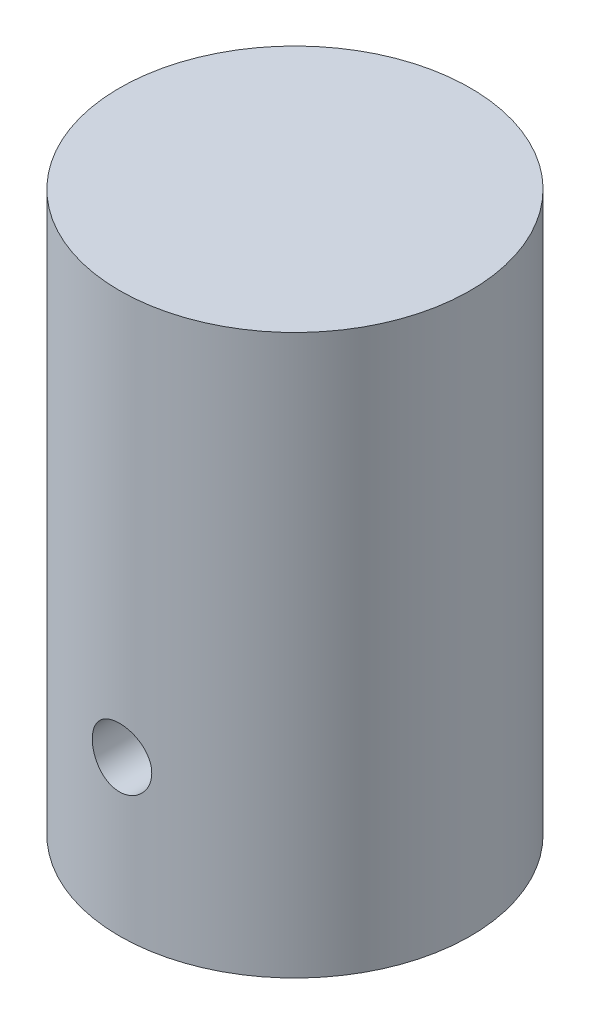
ISO-10303-21;
HEADER;
FILE_DESCRIPTION(('STEP AP214'),'2;1');
FILE_NAME('part.step','',(''),(''),'','','');
FILE_SCHEMA(('AUTOMOTIVE_DESIGN { 1 0 10303 214 1 1 1 1 }'));
ENDSEC;
DATA;
#1=APPLICATION_CONTEXT('core data for automotive mechanical design processes');
#2=APPLICATION_PROTOCOL_DEFINITION('international standard','automotive_design',2000,#1);
#3=PRODUCT_CONTEXT('',#1,'mechanical');
#4=PRODUCT('Part','Part','',(#3));
#5=PRODUCT_RELATED_PRODUCT_CATEGORY('part','',(#4));
#6=PRODUCT_DEFINITION_FORMATION('','',#4);
#7=PRODUCT_DEFINITION_CONTEXT('part definition',#1,'design');
#8=PRODUCT_DEFINITION('design','',#6,#7);
#9=PRODUCT_DEFINITION_SHAPE('','',#8);
#10=(LENGTH_UNIT() NAMED_UNIT(*) SI_UNIT(.MILLI.,.METRE.));
#11=(NAMED_UNIT(*) PLANE_ANGLE_UNIT() SI_UNIT($,.RADIAN.));
#12=(NAMED_UNIT(*) SI_UNIT($,.STERADIAN.) SOLID_ANGLE_UNIT());
#13=UNCERTAINTY_MEASURE_WITH_UNIT(LENGTH_MEASURE(1.E-05),#10,'distance_accuracy_value','');
#14=(GEOMETRIC_REPRESENTATION_CONTEXT(3) GLOBAL_UNCERTAINTY_ASSIGNED_CONTEXT((#13)) GLOBAL_UNIT_ASSIGNED_CONTEXT((#10,
#11,#12)) REPRESENTATION_CONTEXT('',''));
#15=CARTESIAN_POINT('',(0.,0.,0.));
#16=DIRECTION('',(0.,0.,1.));
#17=DIRECTION('',(1.,0.,0.));
#18=AXIS2_PLACEMENT_3D('',#15,#16,#17);
#19=CARTESIAN_POINT('',(0.,119.38,0.));
#20=DIRECTION('',(0.,-1.,0.));
#21=DIRECTION('',(0.,0.,-1.));
#22=AXIS2_PLACEMENT_3D('',#19,#20,#21);
#23=CYLINDRICAL_SURFACE('',#22,37.465);
#24=CARTESIAN_POINT('',(6.35,33.02,36.9229430706708));
#25=CARTESIAN_POINT('',(6.35000279141171,32.8429779279102,36.9229417748591));
#26=CARTESIAN_POINT('',(6.34259532528094,32.6659933481382,36.924218600387));
#27=CARTESIAN_POINT('',(6.3130271330691,32.313242688087,36.9292858540445));
#28=CARTESIAN_POINT('',(6.29086351707607,32.1374768533069,36.9330767745454));
#29=CARTESIAN_POINT('',(6.23193058823662,31.7883737158959,36.9430663826917));
#30=CARTESIAN_POINT('',(6.19515215922365,31.6150379990775,36.9492665730948));
#31=CARTESIAN_POINT('',(6.10725675226593,31.2720688886345,36.9638962260846));
#32=CARTESIAN_POINT('',(6.05613450827856,31.1024368794501,36.9723265073391));
#33=CARTESIAN_POINT('',(5.94001398475862,30.7683400061689,36.9911598987731));
#34=CARTESIAN_POINT('',(5.87503283304677,30.6038690489028,37.0015605720459));
#35=CARTESIAN_POINT('',(5.73160931419481,30.2809531587946,37.024048226987));
#36=CARTESIAN_POINT('',(5.65316198508221,30.1225104736148,37.0361358299416));
#37=CARTESIAN_POINT('',(5.48342916226199,29.8128734349299,37.0616457673502));
#38=CARTESIAN_POINT('',(5.39214998328585,29.6616755649309,37.0750674443417));
#39=CARTESIAN_POINT('',(5.19733044249672,29.367411205207,37.1028794422679));
#40=CARTESIAN_POINT('',(5.09378551997719,29.2243477695128,37.1172701226382));
#41=CARTESIAN_POINT('',(4.87421779068985,28.9461597195228,37.146744116124));
#42=CARTESIAN_POINT('',(4.75809364747908,28.8111156041066,37.1618323914032));
#43=CARTESIAN_POINT('',(4.51488121897134,28.551215519359,37.1921643883722));
#44=CARTESIAN_POINT('',(4.3877888897322,28.4263633410675,37.2074081655528));
#45=CARTESIAN_POINT('',(4.12358831809976,28.1877967478572,37.2376142207968));
#46=CARTESIAN_POINT('',(3.98648315756614,28.0740789308957,37.2525765837088));
#47=CARTESIAN_POINT('',(3.70310692352254,27.858487943453,37.281812153211));
#48=CARTESIAN_POINT('',(3.55683248965142,27.7566191549295,37.2960851037118));
#49=CARTESIAN_POINT('',(3.25528646093831,27.564937093672,37.3236169600895));
#50=CARTESIAN_POINT('',(3.09996739305173,27.4751975512082,37.3368694703722));
#51=CARTESIAN_POINT('',(2.78214446136281,27.309103441585,37.3618966515687));
#52=CARTESIAN_POINT('',(2.61963794116679,27.2327538758421,37.3736707698099));
#53=CARTESIAN_POINT('',(2.28869512625808,27.0940797494783,37.3953948025334));
#54=CARTESIAN_POINT('',(2.12026136913199,27.0317492694472,37.4053454866114));
#55=CARTESIAN_POINT('',(1.77860742000098,26.9215298267097,37.4231499027759));
#56=CARTESIAN_POINT('',(1.60538550554222,26.8736461367658,37.4310028691218));
#57=CARTESIAN_POINT('',(1.08386846683103,26.7531119562433,37.4509148486679));
#58=CARTESIAN_POINT('',(0.73015872504387,26.7020912500178,37.4595677631988));
#59=CARTESIAN_POINT('',(0.0192946776186457,26.6600414383014,37.4666841086695));
#60=CARTESIAN_POINT('',(-0.337859384488472,26.669008122004,37.4651482548085));
#61=CARTESIAN_POINT('',(-1.04184938818574,26.7461584808905,37.4521482632217));
#62=CARTESIAN_POINT('',(-1.38875354291931,26.8137347170075,37.4407859717608));
#63=CARTESIAN_POINT('',(-2.06621277185893,27.0052502774216,37.4095186888445));
#64=CARTESIAN_POINT('',(-2.39676733453492,27.1291913639717,37.3896134302934));
#65=CARTESIAN_POINT('',(-3.03396211682997,27.4305133275901,37.3433249625064));
#66=CARTESIAN_POINT('',(-3.34048213700312,27.6081436009934,37.316911630219));
#67=CARTESIAN_POINT('',(-3.91959227462119,28.0116203392101,37.2605395168837));
#68=CARTESIAN_POINT('',(-4.19217955142351,28.2374708364357,37.2305804394166));
#69=CARTESIAN_POINT('',(-4.69927895714922,28.7343438510591,37.1700034224869));
#70=CARTESIAN_POINT('',(-4.93327053922575,29.0058975034978,37.1393819324612));
#71=CARTESIAN_POINT('',(-5.35245392593285,29.5846815641848,37.0812942455192));
#72=CARTESIAN_POINT('',(-5.53764525006624,29.8919123236743,37.0538280796725));
#73=CARTESIAN_POINT('',(-5.85407953710823,30.5339442406,37.0051585911984));
#74=CARTESIAN_POINT('',(-5.98525815710648,30.8687777135642,36.9839627465329));
#75=CARTESIAN_POINT('',(-6.18936206426045,31.556167311694,36.9503562312994));
#76=CARTESIAN_POINT('',(-6.26229266738911,31.9087218164371,36.9379447590422));
#77=CARTESIAN_POINT('',(-6.34709384460755,32.6168835055322,36.9234678421246));
#78=CARTESIAN_POINT('',(-6.35970721768158,32.9723992502977,36.9212765456527));
#79=CARTESIAN_POINT('',(-6.32549683373919,33.6804613982253,36.9271526737609));
#80=CARTESIAN_POINT('',(-6.27867545446003,34.0330079196058,36.9352196879487));
#81=CARTESIAN_POINT('',(-6.12755856328144,34.7227539742049,36.9605870866626));
#82=CARTESIAN_POINT('',(-6.02364259931067,35.0600391050828,36.9778264723004));
#83=CARTESIAN_POINT('',(-5.76168490296192,35.7124080067798,37.0195448040393));
#84=CARTESIAN_POINT('',(-5.60363983348741,36.0274904073409,37.0440241964792));
#85=CARTESIAN_POINT('',(-5.23616310891025,36.629811414514,37.0977560143979));
#86=CARTESIAN_POINT('',(-5.02625632334476,36.9167562145644,37.1270516831742));
#87=CARTESIAN_POINT('',(-4.56166401992295,37.4516159849238,37.1869892749972));
#88=CARTESIAN_POINT('',(-4.30697524051591,37.6995281099207,37.217631295979));
#89=CARTESIAN_POINT('',(-3.75675903815107,38.1520061184341,37.2772080912782));
#90=CARTESIAN_POINT('',(-3.46082109485542,38.3560760897849,37.3061209088732));
#91=CARTESIAN_POINT('',(-2.83841657324286,38.7115984068522,37.3586264947807));
#92=CARTESIAN_POINT('',(-2.51195100873064,38.8630524991246,37.3822194396744));
#93=CARTESIAN_POINT('',(-1.83928606066536,39.1082817900893,37.421334207005));
#94=CARTESIAN_POINT('',(-1.49318246426715,39.2023144056904,37.4368920013525));
#95=CARTESIAN_POINT('',(-0.789612381808293,39.33083762764,37.4583264559331));
#96=CARTESIAN_POINT('',(-0.432146866718397,39.365333308058,37.4642039411742));
#97=CARTESIAN_POINT('',(0.101984465339863,39.3716501433896,37.4652822069458));
#98=CARTESIAN_POINT('',(0.278660824538069,39.3663448034955,37.4643792461815));
#99=CARTESIAN_POINT('',(0.630910248375704,39.3410416873006,37.4600999348255));
#100=CARTESIAN_POINT('',(0.806483702727592,39.3210494338571,37.4567245139773));
#101=CARTESIAN_POINT('',(1.15534231245423,39.2665096396473,37.4475887044141));
#102=CARTESIAN_POINT('',(1.32862663390469,39.2319569375789,37.4418274700023));
#103=CARTESIAN_POINT('',(1.67157269701812,39.1485780582277,37.4280844037534));
#104=CARTESIAN_POINT('',(1.84123571960936,39.0997570208375,37.4201033716055));
#105=CARTESIAN_POINT('',(2.17567198668656,38.9882491419048,37.4021483486495));
#106=CARTESIAN_POINT('',(2.34044923358439,38.925574026656,37.3921760439695));
#107=CARTESIAN_POINT('',(2.66407136469494,38.7868196261229,37.3705130033313));
#108=CARTESIAN_POINT('',(2.82291834908299,38.7107451418,37.3588228831101));
#109=CARTESIAN_POINT('',(3.13372361602806,38.5456899649814,37.3340369935162));
#110=CARTESIAN_POINT('',(3.28567916728831,38.4567042130054,37.3209406736277));
#111=CARTESIAN_POINT('',(3.58156051285462,38.266507812355,37.2937088207987));
#112=CARTESIAN_POINT('',(3.72548910131004,38.1653014569379,37.2795736534978));
#113=CARTESIAN_POINT('',(4.0061175405423,37.9500279829882,37.2504683547157));
#114=CARTESIAN_POINT('',(4.14270774436707,37.8358189937871,37.2354901389976));
#115=CARTESIAN_POINT('',(4.40575720486539,37.5963983703591,37.2052826069384));
#116=CARTESIAN_POINT('',(4.53222005739372,37.4711906747823,37.1900533820582));
#117=CARTESIAN_POINT('',(4.77427711512343,37.2105169336016,37.1597550265217));
#118=CARTESIAN_POINT('',(4.8898647624007,37.0750447861258,37.1446859972621));
#119=CARTESIAN_POINT('',(5.10924511026962,36.7948850831837,37.1151463601762));
#120=CARTESIAN_POINT('',(5.2130421433657,36.6502009433935,37.1006755337894));
#121=CARTESIAN_POINT('',(5.40891750548062,36.3514062770834,37.0726274388618));
#122=CARTESIAN_POINT('',(5.50089893076861,36.1972314673241,37.0590579519227));
#123=CARTESIAN_POINT('',(5.67149208696552,35.8816160179082,37.0333342280351));
#124=CARTESIAN_POINT('',(5.75010873763827,35.720178079709,37.0211794708262));
#125=CARTESIAN_POINT('',(5.89338024297566,35.3912284690087,36.9986426334629));
#126=CARTESIAN_POINT('',(5.95804473056657,35.2237210809342,36.9882593312945));
#127=CARTESIAN_POINT('',(6.0729737087923,34.8837837201648,36.9695630766091));
#128=CARTESIAN_POINT('',(6.1232412714356,34.7113548062705,36.9612496824657));
#129=CARTESIAN_POINT('',(6.22707453855869,34.2892845729493,36.9439259134538));
#130=CARTESIAN_POINT('',(6.27311607180392,34.037703905521,36.9360961033579));
#131=CARTESIAN_POINT('',(6.3345764955392,33.530722778203,36.9256056660701));
#132=CARTESIAN_POINT('',(6.34999597389238,33.2753223917367,36.9229449396454));
#133=CARTESIAN_POINT('',(6.35,33.02,36.9229430706708));
#134=B_SPLINE_CURVE_WITH_KNOTS('',3,(#24,#25,#26,#27,#28,#29,#30,#31,#32,#33,#34,#35,#36,#37,
#38,#39,#40,#41,#42,#43,#44,#45,#46,#47,#48,#49,#50,#51,#52,#53,#54,#55,#56,#57,#58,#59,#60,#61,
#62,#63,#64,#65,#66,#67,#68,#69,#70,#71,#72,#73,#74,#75,#76,#77,#78,#79,#80,#81,#82,#83,#84,#85,
#86,#87,#88,#89,#90,#91,#92,#93,#94,#95,#96,#97,#98,#99,#100,#101,#102,#103,#104,#105,#106,#107,
#108,#109,#110,#111,#112,#113,#114,#115,#116,#117,#118,#119,#120,#121,#122,#123,#124,#125,#126,
#127,#128,#129,#130,#131,#132,#133),.UNSPECIFIED.,.T.,.F.,(4,2,2,2,2,2,2,2,2,2,2,2,2,2,2,2,2,2,
2,2,2,2,2,2,2,2,2,2,2,2,2,2,2,2,2,2,2,2,2,2,2,2,2,2,2,2,2,2,2,2,2,2,2,2,4),(0.,
0.530842262782578,1.06178851873756,1.59306648002144,2.12453974509419,2.65535994507213,
3.18637616143376,3.71713196622598,4.24808574227657,4.783689476758,5.31949153759851,
5.85512937282707,6.39096466978,6.92992324743332,7.46908270980697,8.00801408863622,
8.54714192834565,9.61394141379653,10.6806660161912,11.7364652602675,12.7922975162911,
13.853111719601,14.9140146681803,15.9882265295015,17.0624489673338,18.1379474014621,
19.2133476696029,20.2754698080297,21.337549456706,22.3926526711854,23.4478209452153,
24.5130399581971,25.5783365850975,26.6551133948241,27.7318544581056,28.8037324268096,
29.8755190395879,30.4052775528997,30.9348369580735,31.4645842364605,31.9941409183267,
32.5232510804091,33.0521720478237,33.5813008437124,34.1102442876548,34.6456425169921,
35.1808497951281,35.7163777706953,36.2517083235993,36.7911816411863,37.3304559389127,
37.8693567080755,38.408142401051,39.1738012625574,39.9394454252798),.UNSPECIFIED.);
#135=CARTESIAN_POINT('',(6.35,33.02,36.9229430706708));
#136=VERTEX_POINT('',#135);
#137=EDGE_CURVE('E10',#136,#136,#134,.T.);
#138=ORIENTED_EDGE('',*,*,#137,.T.);
#139=EDGE_LOOP('',(#138));
#140=FACE_BOUND('',#139,.T.);
#141=CARTESIAN_POINT('',(0.,119.38,0.));
#142=DIRECTION('',(0.,1.,0.));
#143=DIRECTION('',(0.,0.,1.));
#144=AXIS2_PLACEMENT_3D('',#141,#142,#143);
#145=CIRCLE('',#144,37.465);
#146=CARTESIAN_POINT('',(0.,119.38,37.465));
#147=VERTEX_POINT('',#146);
#148=EDGE_CURVE('E41',#147,#147,#145,.T.);
#149=ORIENTED_EDGE('',*,*,#148,.F.);
#150=EDGE_LOOP('',(#149));
#151=FACE_BOUND('',#150,.T.);
#152=CARTESIAN_POINT('',(0.,0.,0.));
#153=DIRECTION('',(0.,1.,0.));
#154=DIRECTION('',(0.,0.,1.));
#155=AXIS2_PLACEMENT_3D('',#152,#153,#154);
#156=CIRCLE('',#155,37.465);
#157=CARTESIAN_POINT('',(0.,0.,37.465));
#158=VERTEX_POINT('',#157);
#159=EDGE_CURVE('E45',#158,#158,#156,.T.);
#160=ORIENTED_EDGE('',*,*,#159,.T.);
#161=EDGE_LOOP('',(#160));
#162=FACE_BOUND('',#161,.T.);
#163=ADVANCED_FACE('F30',(#140,#151,#162),#23,.T.);
#164=CARTESIAN_POINT('',(0.,119.38,0.));
#165=DIRECTION('',(0.,1.,0.));
#166=DIRECTION('',(0.,0.,1.));
#167=AXIS2_PLACEMENT_3D('',#164,#165,#166);
#168=PLANE('',#167);
#169=ORIENTED_EDGE('',*,*,#148,.T.);
#170=EDGE_LOOP('',(#169));
#171=FACE_BOUND('',#170,.T.);
#172=ADVANCED_FACE('F74',(#171),#168,.T.);
#173=CARTESIAN_POINT('',(0.,0.,0.));
#174=DIRECTION('',(0.,1.,0.));
#175=DIRECTION('',(0.,0.,1.));
#176=AXIS2_PLACEMENT_3D('',#173,#174,#175);
#177=PLANE('',#176);
#178=CARTESIAN_POINT('',(0.,0.,0.));
#179=DIRECTION('',(0.,-1.,0.));
#180=DIRECTION('',(0.,0.,-1.));
#181=AXIS2_PLACEMENT_3D('',#178,#179,#180);
#182=CIRCLE('',#181,6.35);
#183=CARTESIAN_POINT('',(0.,0.,-6.35));
#184=VERTEX_POINT('',#183);
#185=EDGE_CURVE('E55',#184,#184,#182,.T.);
#186=ORIENTED_EDGE('',*,*,#185,.F.);
#187=EDGE_LOOP('',(#186));
#188=FACE_BOUND('',#187,.T.);
#189=ORIENTED_EDGE('',*,*,#159,.F.);
#190=EDGE_LOOP('',(#189));
#191=FACE_BOUND('',#190,.T.);
#192=ADVANCED_FACE('F70',(#188,#191),#177,.F.);
#193=CARTESIAN_POINT('',(0.,33.02,18.415));
#194=DIRECTION('',(0.,0.,1.));
#195=DIRECTION('',(1.,0.,0.));
#196=AXIS2_PLACEMENT_3D('',#193,#194,#195);
#197=CYLINDRICAL_SURFACE('',#196,6.35);
#198=CARTESIAN_POINT('',(0.,33.02,18.415));
#199=DIRECTION('',(0.,0.,1.));
#200=DIRECTION('',(1.,0.,0.));
#201=AXIS2_PLACEMENT_3D('',#198,#199,#200);
#202=CIRCLE('',#201,6.35);
#203=CARTESIAN_POINT('',(6.35,33.02,18.415));
#204=VERTEX_POINT('',#203);
#205=EDGE_CURVE('E50',#204,#204,#202,.T.);
#206=ORIENTED_EDGE('',*,*,#205,.F.);
#207=EDGE_LOOP('',(#206));
#208=FACE_BOUND('',#207,.T.);
#209=ORIENTED_EDGE('',*,*,#137,.F.);
#210=EDGE_LOOP('',(#209));
#211=FACE_BOUND('',#210,.T.);
#212=ADVANCED_FACE('F73',(#208,#211),#197,.F.);
#213=CARTESIAN_POINT('',(0.,33.02,18.415));
#214=DIRECTION('',(0.,0.,1.));
#215=DIRECTION('',(1.,0.,0.));
#216=AXIS2_PLACEMENT_3D('',#213,#214,#215);
#217=PLANE('',#216);
#218=ORIENTED_EDGE('',*,*,#205,.T.);
#219=EDGE_LOOP('',(#218));
#220=FACE_BOUND('',#219,.T.);
#221=ADVANCED_FACE('F66',(#220),#217,.T.);
#222=CARTESIAN_POINT('',(0.,19.05,0.));
#223=DIRECTION('',(0.,-1.,0.));
#224=DIRECTION('',(0.,0.,-1.));
#225=AXIS2_PLACEMENT_3D('',#222,#223,#224);
#226=CYLINDRICAL_SURFACE('',#225,6.35);
#227=CARTESIAN_POINT('',(0.,19.05,0.));
#228=DIRECTION('',(0.,-1.,0.));
#229=DIRECTION('',(0.,0.,-1.));
#230=AXIS2_PLACEMENT_3D('',#227,#228,#229);
#231=CIRCLE('',#230,6.35);
#232=CARTESIAN_POINT('',(0.,19.05,-6.35));
#233=VERTEX_POINT('',#232);
#234=EDGE_CURVE('E54',#233,#233,#231,.T.);
#235=ORIENTED_EDGE('',*,*,#234,.F.);
#236=EDGE_LOOP('',(#235));
#237=FACE_BOUND('',#236,.T.);
#238=ORIENTED_EDGE('',*,*,#185,.T.);
#239=EDGE_LOOP('',(#238));
#240=FACE_BOUND('',#239,.T.);
#241=ADVANCED_FACE('F63',(#237,#240),#226,.F.);
#242=CARTESIAN_POINT('',(0.,19.05,0.));
#243=DIRECTION('',(0.,-1.,0.));
#244=DIRECTION('',(0.,0.,-1.));
#245=AXIS2_PLACEMENT_3D('',#242,#243,#244);
#246=PLANE('',#245);
#247=ORIENTED_EDGE('',*,*,#234,.T.);
#248=EDGE_LOOP('',(#247));
#249=FACE_BOUND('',#248,.T.);
#250=ADVANCED_FACE('F61',(#249),#246,.T.);
#251=CLOSED_SHELL('',(#163,#172,#192,#212,#221,#241,#250));
#252=MANIFOLD_SOLID_BREP('B2',#251);
#253=ADVANCED_BREP_SHAPE_REPRESENTATION('',(#18,#252),#14);
#254=SHAPE_DEFINITION_REPRESENTATION(#9,#253);
ENDSEC;
END-ISO-10303-21;
